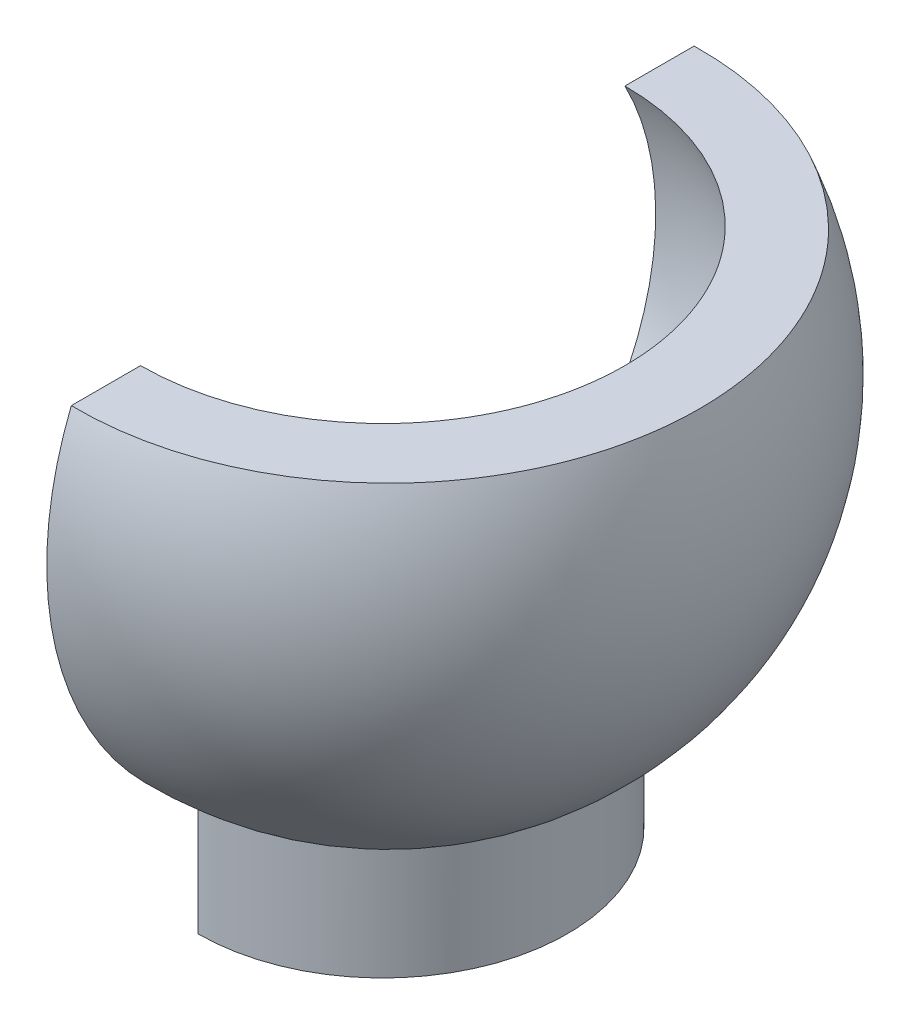
ISO-10303-21;
HEADER;
FILE_DESCRIPTION(('STEP AP214'),'2;1');
FILE_NAME('part.step','',(''),(''),'','','');
FILE_SCHEMA(('AUTOMOTIVE_DESIGN { 1 0 10303 214 1 1 1 1 }'));
ENDSEC;
DATA;
#1=APPLICATION_CONTEXT('core data for automotive mechanical design processes');
#2=APPLICATION_PROTOCOL_DEFINITION('international standard','automotive_design',2000,#1);
#3=PRODUCT_CONTEXT('',#1,'mechanical');
#4=PRODUCT('Part','Part','',(#3));
#5=PRODUCT_RELATED_PRODUCT_CATEGORY('part','',(#4));
#6=PRODUCT_DEFINITION_FORMATION('','',#4);
#7=PRODUCT_DEFINITION_CONTEXT('part definition',#1,'design');
#8=PRODUCT_DEFINITION('design','',#6,#7);
#9=PRODUCT_DEFINITION_SHAPE('','',#8);
#10=(LENGTH_UNIT() NAMED_UNIT(*) SI_UNIT(.MILLI.,.METRE.));
#11=(NAMED_UNIT(*) PLANE_ANGLE_UNIT() SI_UNIT($,.RADIAN.));
#12=(NAMED_UNIT(*) SI_UNIT($,.STERADIAN.) SOLID_ANGLE_UNIT());
#13=UNCERTAINTY_MEASURE_WITH_UNIT(LENGTH_MEASURE(1.E-05),#10,'distance_accuracy_value','');
#14=(GEOMETRIC_REPRESENTATION_CONTEXT(3) GLOBAL_UNCERTAINTY_ASSIGNED_CONTEXT((#13)) GLOBAL_UNIT_ASSIGNED_CONTEXT((#10,
#11,#12)) REPRESENTATION_CONTEXT('',''));
#15=CARTESIAN_POINT('',(0.,0.,0.));
#16=DIRECTION('',(0.,0.,1.));
#17=DIRECTION('',(1.,0.,0.));
#18=AXIS2_PLACEMENT_3D('',#15,#16,#17);
#19=CARTESIAN_POINT('',(0.318469420270132,0.,0.));
#20=DIRECTION('',(1.,0.,0.));
#21=DIRECTION('',(0.,0.,-1.));
#22=AXIS2_PLACEMENT_3D('',#19,#20,#21);
#23=SPHERICAL_SURFACE('',#22,20.);
#24=CARTESIAN_POINT('',(0.318469420270132,7.5,0.));
#25=DIRECTION('',(0.,-1.,0.));
#26=DIRECTION('',(0.,0.,1.));
#27=AXIS2_PLACEMENT_3D('',#24,#25,#26);
#28=CIRCLE('',#27,18.5404962177392);
#29=CARTESIAN_POINT('',(0.,7.5,-18.53776084721));
#30=VERTEX_POINT('',#29);
#31=CARTESIAN_POINT('',(0.,7.5,18.53776084721));
#32=VERTEX_POINT('',#31);
#33=EDGE_CURVE('E88',#30,#32,#28,.T.);
#34=ORIENTED_EDGE('',*,*,#33,.T.);
#35=CARTESIAN_POINT('',(0.,0.,0.));
#36=DIRECTION('',(-1.,0.,0.));
#37=DIRECTION('',(0.,0.,1.));
#38=AXIS2_PLACEMENT_3D('',#35,#36,#37);
#39=CIRCLE('',#38,19.9974642699607);
#40=CARTESIAN_POINT('',(0.,-16.7002568012696,11.));
#41=VERTEX_POINT('',#40);
#42=EDGE_CURVE('E121',#41,#32,#39,.T.);
#43=ORIENTED_EDGE('',*,*,#42,.F.);
#44=CARTESIAN_POINT('',(-10.4486910905099,-16.4998,3.43872861608761));
#45=CARTESIAN_POINT('',(-10.3520099832137,-16.5016660675455,3.73260385765806));
#46=CARTESIAN_POINT('',(-10.2428717104174,-16.5037722891326,4.02237271646154));
#47=CARTESIAN_POINT('',(-10.0005990145659,-16.5084467140785,4.59167935130273));
#48=CARTESIAN_POINT('',(-9.8674657602793,-16.5110148949357,4.87121762486325));
#49=CARTESIAN_POINT('',(-9.57821442973688,-16.5165931160298,5.41787961061132));
#50=CARTESIAN_POINT('',(-9.42211274310275,-16.5196028411887,5.68501199792606));
#51=CARTESIAN_POINT('',(-9.0879761495767,-16.5260431628054,6.20517762148084));
#52=CARTESIAN_POINT('',(-8.90994150481221,-16.5294737542332,6.45821102616962));
#53=CARTESIAN_POINT('',(-8.53311257688292,-16.536732433185,6.94849864948354));
#54=CARTESIAN_POINT('',(-8.33430864241363,-16.540560705503,7.18574544763739));
#55=CARTESIAN_POINT('',(-7.91742485755524,-16.5485853751575,7.64264483067634));
#56=CARTESIAN_POINT('',(-7.69934500212475,-16.5527817725904,7.86229741095986));
#57=CARTESIAN_POINT('',(-7.24550409597118,-16.5615112018977,8.28240715241219));
#58=CARTESIAN_POINT('',(-7.00974645052565,-16.566044168937,8.48286799363849));
#59=CARTESIAN_POINT('',(-6.52219028333347,-16.5754144098355,8.86321768096938));
#60=CARTESIAN_POINT('',(-6.27039183270186,-16.5802516823456,9.04310661826722));
#61=CARTESIAN_POINT('',(-5.75250380402007,-16.5901961666031,9.38106176216871));
#62=CARTESIAN_POINT('',(-5.48641208158701,-16.5953034188531,9.53912468149798));
#63=CARTESIAN_POINT('',(-4.94186328418899,-16.6057502040994,9.83227363910732));
#64=CARTESIAN_POINT('',(-4.66340618668138,-16.6110897375193,9.96735963549719));
#65=CARTESIAN_POINT('',(-4.09606315014395,-16.621963334255,10.2136140015553));
#66=CARTESIAN_POINT('',(-3.8071756361832,-16.6274974269449,10.3247787414696));
#67=CARTESIAN_POINT('',(-3.22106542257375,-16.6387195129622,10.5223752038536));
#68=CARTESIAN_POINT('',(-2.92384272576658,-16.6444075062371,10.6088069347547));
#69=CARTESIAN_POINT('',(-2.32313838200115,-16.6558972489325,10.7563326448529));
#70=CARTESIAN_POINT('',(-2.0196559838272,-16.6616990120022,10.8174235641532));
#71=CARTESIAN_POINT('',(-1.40862446542454,-16.6733740937544,10.9138187648366));
#72=CARTESIAN_POINT('',(-1.1010753445032,-16.6792474124493,10.9491230418277));
#73=CARTESIAN_POINT('',(-0.484115889868616,-16.6910233263341,10.9936928383378));
#74=CARTESIAN_POINT('',(-0.174705673000839,-16.696925919682,11.002959975798));
#75=CARTESIAN_POINT('',(0.443795718501033,-16.7087187637856,10.9953942932697));
#76=CARTESIAN_POINT('',(0.752886893148376,-16.7146090145417,10.978561474365));
#77=CARTESIAN_POINT('',(1.3685852901587,-16.7263360226243,10.9189122561017));
#78=CARTESIAN_POINT('',(1.67519225112046,-16.7321727743296,10.8760931574155));
#79=CARTESIAN_POINT('',(2.28370988979444,-16.743750902155,10.7647731339014));
#80=CARTESIAN_POINT('',(2.58562056691049,-16.749492278263,10.6962722058133));
#81=CARTESIAN_POINT('',(3.18260525764254,-16.7608393084394,10.5340733127363));
#82=CARTESIAN_POINT('',(3.47767912854026,-16.7664449596747,10.4403748222623));
#83=CARTESIAN_POINT('',(4.05888541093351,-16.7774810221449,10.2284469860156));
#84=CARTESIAN_POINT('',(4.34501782288489,-16.7829114333888,10.1102176414936));
#85=CARTESIAN_POINT('',(4.90629471890557,-16.7935587426303,9.85007334471878));
#86=CARTESIAN_POINT('',(5.18143965459545,-16.7987756494039,9.70815936722488));
#87=CARTESIAN_POINT('',(5.71879716220215,-16.8089597297368,9.40165060926966));
#88=CARTESIAN_POINT('',(5.98100973427018,-16.8139269032989,9.23705582907355));
#89=CARTESIAN_POINT('',(6.49063565710455,-16.8235768629414,8.88635613533882));
#90=CARTESIAN_POINT('',(6.73804910295006,-16.8282596508489,8.70025136001687));
#91=CARTESIAN_POINT('',(7.21631836733921,-16.8373083109268,8.30785342870468));
#92=CARTESIAN_POINT('',(7.44717418767978,-16.8416741831317,8.10156027490542));
#93=CARTESIAN_POINT('',(7.8906563429622,-16.8500581692213,7.67028028398163));
#94=CARTESIAN_POINT('',(8.10328506943565,-16.8540763287293,7.44529590693729));
#95=CARTESIAN_POINT('',(8.50883410247821,-16.8617377169598,6.97820909767695));
#96=CARTESIAN_POINT('',(8.70175441040194,-16.865380945708,6.73610666663752));
#97=CARTESIAN_POINT('',(9.06651386462534,-16.8722673022126,6.23650457808338));
#98=CARTESIAN_POINT('',(9.23835299298679,-16.8755104296284,5.97900490746725));
#99=CARTESIAN_POINT('',(9.55972680020424,-16.8815742076838,5.45043935237423));
#100=CARTESIAN_POINT('',(9.70926148162447,-16.8843948583721,5.17937346945698));
#101=CARTESIAN_POINT('',(9.9849377666958,-16.8895937983234,4.62565156724651));
#102=CARTESIAN_POINT('',(10.1110834598625,-16.8919721649192,4.34299758468201));
#103=CARTESIAN_POINT('',(10.3391162856015,-16.8962707894624,3.76806463740849));
#104=CARTESIAN_POINT('',(10.4410034209142,-16.8981910474616,3.47578567378682));
#105=CARTESIAN_POINT('',(10.6197938026897,-16.9015602599419,2.88368130908519));
#106=CARTESIAN_POINT('',(10.6966970746312,-16.9030092149037,2.58385591570148));
#107=CARTESIAN_POINT('',(10.8249724111361,-16.9054258765414,1.97879052527897));
#108=CARTESIAN_POINT('',(10.8763444775881,-16.9063935832529,1.67355052864074));
#109=CARTESIAN_POINT('',(10.9531862992757,-16.9078410075007,1.05986968490491));
#110=CARTESIAN_POINT('',(10.9786596779469,-16.9083207933009,0.75142929167029));
#111=CARTESIAN_POINT('',(11.0035354487566,-16.908789323739,0.133498621511905));
#112=CARTESIAN_POINT('',(11.0029378435888,-16.9087780684275,-0.175991655303387));
#113=CARTESIAN_POINT('',(10.9756759096898,-16.9082645940349,-0.793821462876034));
#114=CARTESIAN_POINT('',(10.9490115917817,-16.9077623751578,-1.10216099411113));
#115=CARTESIAN_POINT('',(10.869806034012,-16.9062704176933,-1.71549714916166));
#116=CARTESIAN_POINT('',(10.8172647942037,-16.9052806791069,-2.02049377298399));
#117=CARTESIAN_POINT('',(10.6866823927888,-16.9028205288884,-2.62496157383));
#118=CARTESIAN_POINT('',(10.6086424199275,-16.901350139664,-2.92443300774932));
#119=CARTESIAN_POINT('',(10.4276172303115,-16.8979387667137,-3.51573623907389));
#120=CARTESIAN_POINT('',(10.324632014827,-16.8959977830118,-3.80756803686811));
#121=CARTESIAN_POINT('',(10.0944490652742,-16.8916585513587,-4.38151786109732));
#122=CARTESIAN_POINT('',(9.96725131988663,-16.8892603031939,-4.66363588299111));
#123=CARTESIAN_POINT('',(9.68954829059844,-16.8840230317175,-5.21615303546429));
#124=CARTESIAN_POINT('',(9.53904300502315,-16.8811840083742,-5.48655216520169));
#125=CARTESIAN_POINT('',(9.21578463096101,-16.8750845243206,-6.01372784638748));
#126=CARTESIAN_POINT('',(9.04303004552077,-16.8718240352536,-6.27050347959168));
#127=CARTESIAN_POINT('',(8.67650983423113,-16.8649042484251,-6.76858799373889));
#128=CARTESIAN_POINT('',(8.48274420790317,-16.8612449506547,-7.00989687432962));
#129=CARTESIAN_POINT('',(8.07558020246493,-16.853552821479,-7.47533328335196));
#130=CARTESIAN_POINT('',(7.86218184242896,-16.8495199904368,-7.69946082847583));
#131=CARTESIAN_POINT('',(7.41726965204664,-16.8411086940044,-8.12894281901709));
#132=CARTESIAN_POINT('',(7.1857558196905,-16.836730228576,-8.33429726235173));
#133=CARTESIAN_POINT('',(6.70622263113865,-16.8276573376337,-8.72480396613765));
#134=CARTESIAN_POINT('',(6.45820080190027,-16.822962864778,-8.90995318865352));
#135=CARTESIAN_POINT('',(5.94744625089713,-16.8132911747974,-9.25869896832882));
#136=CARTESIAN_POINT('',(5.68471352782633,-16.8083139576473,-9.42229552357478));
#137=CARTESIAN_POINT('',(5.14640352441548,-16.798111427797,-9.72677503874337));
#138=CARTESIAN_POINT('',(4.87082617205261,-16.7928861137056,-9.86765787128513));
#139=CARTESIAN_POINT('',(4.30878713948868,-16.782223914907,-10.1257085148584));
#140=CARTESIAN_POINT('',(4.02232545801481,-16.7767870301751,-10.2428763231167));
#141=CARTESIAN_POINT('',(3.44050223296918,-16.7657387922299,-10.4526836562041));
#142=CARTESIAN_POINT('',(3.14513912416919,-16.7601274083272,-10.5453188388522));
#143=CARTESIAN_POINT('',(2.54766110912213,-16.748770515582,-10.7053758675295));
#144=CARTESIAN_POINT('',(2.24554620210348,-16.7430250067243,-10.7727977106772));
#145=CARTESIAN_POINT('',(1.63671609550183,-16.731440428984,-10.8819486386248));
#146=CARTESIAN_POINT('',(1.33000095610911,-16.7256013613257,-10.9236780592889));
#147=CARTESIAN_POINT('',(0.714146537759701,-16.7138708651346,-10.9811492859176));
#148=CARTESIAN_POINT('',(0.405007258785045,-16.7079794366014,-10.9968910916895));
#149=CARTESIAN_POINT('',(-0.213532674233275,-16.6961853353722,-11.0022756535453));
#150=CARTESIAN_POINT('',(-0.522933353489004,-16.6902826615002,-10.9919155113116));
#151=CARTESIAN_POINT('',(-1.13976234949737,-16.6785087156003,-10.9451636698207));
#152=CARTESIAN_POINT('',(-1.44719066575797,-16.6726374435804,-10.9087719640699));
#153=CARTESIAN_POINT('',(-2.05789829867899,-16.6609680366465,-10.8102140010129));
#154=CARTESIAN_POINT('',(-2.36117749380162,-16.6551699038755,-10.7480469903483));
#155=CARTESIAN_POINT('',(-2.96142125439994,-16.6436884724156,-10.5983799370239));
#156=CARTESIAN_POINT('',(-3.25838582392825,-16.6380051736531,-10.5108799106228));
#157=CARTESIAN_POINT('',(-3.84388957225686,-16.6267942215232,-10.3111681201724));
#158=CARTESIAN_POINT('',(-4.13242873475546,-16.6212665684569,-10.1989563083137));
#159=CARTESIAN_POINT('',(-4.69903000528824,-16.6104067378104,-9.9506177944535));
#160=CARTESIAN_POINT('',(-4.97709208412435,-16.6050745607748,-9.81449102581059));
#161=CARTESIAN_POINT('',(-5.52075881460794,-16.5946442782144,-9.5192909763738));
#162=CARTESIAN_POINT('',(-5.78636355213812,-16.5895461710758,-9.36021785380619));
#163=CARTESIAN_POINT('',(-6.30322539774932,-16.5796210083792,-9.02025654221474));
#164=CARTESIAN_POINT('',(-6.55448267310545,-16.574793949661,-8.83936860760338));
#165=CARTESIAN_POINT('',(-7.04088092854326,-16.5654456188017,-8.45704976555997));
#166=CARTESIAN_POINT('',(-7.27602086489207,-16.5609243664643,-8.2556175298097));
#167=CARTESIAN_POINT('',(-7.72849669721531,-16.5522208917737,-7.83364760966612));
#168=CARTESIAN_POINT('',(-7.94583239766744,-16.5480386731438,-7.61310971551327));
#169=CARTESIAN_POINT('',(-8.36109707607647,-16.5400449130939,-7.15455940115801));
#170=CARTESIAN_POINT('',(-8.55903063703988,-16.5362332841383,-6.91655113099988));
#171=CARTESIAN_POINT('',(-8.93411995155831,-16.5290079037086,-6.42472626270363));
#172=CARTESIAN_POINT('',(-9.11127951094772,-16.5255940793569,-6.17091257323262));
#173=CARTESIAN_POINT('',(-9.40026441544679,-16.5200238897408,-5.71728382909163));
#174=CARTESIAN_POINT('',(-9.51708571530023,-16.517771648658,-5.52063038839268));
#175=CARTESIAN_POINT('',(-9.73824866419202,-16.5135069854942,-5.12042679288211));
#176=CARTESIAN_POINT('',(-9.84259108842962,-16.5114945485165,-4.9168770674832));
#177=CARTESIAN_POINT('',(-10.0382688967867,-16.5077199348344,-4.50391941420344));
#178=CARTESIAN_POINT('',(-10.1296197512353,-16.5059574604823,-4.29451881531439));
#179=CARTESIAN_POINT('',(-10.2991369791872,-16.5026864327178,-3.87039995169055));
#180=CARTESIAN_POINT('',(-10.3773008767033,-16.5011779269909,-3.65568069698354));
#181=CARTESIAN_POINT('',(-10.4486910905099,-16.4998,-3.43872861608745));
#182=B_SPLINE_CURVE_WITH_KNOTS('',3,(#44,#45,#46,#47,#48,#49,#50,#51,#52,#53,#54,#55,#56,#57,
#58,#59,#60,#61,#62,#63,#64,#65,#66,#67,#68,#69,#70,#71,#72,#73,#74,#75,#76,#77,#78,#79,#80,#81,
#82,#83,#84,#85,#86,#87,#88,#89,#90,#91,#92,#93,#94,#95,#96,#97,#98,#99,#100,#101,#102,#103,
#104,#105,#106,#107,#108,#109,#110,#111,#112,#113,#114,#115,#116,#117,#118,#119,#120,#121,#122,
#123,#124,#125,#126,#127,#128,#129,#130,#131,#132,#133,#134,#135,#136,#137,#138,#139,#140,#141,
#142,#143,#144,#145,#146,#147,#148,#149,#150,#151,#152,#153,#154,#155,#156,#157,#158,#159,#160,
#161,#162,#163,#164,#165,#166,#167,#168,#169,#170,#171,#172,#173,#174,#175,#176,#177,#178,#179,
#180,#181),.UNSPECIFIED.,.F.,.F.,(4,2,2,2,2,2,2,2,2,2,2,2,2,2,2,2,2,2,2,2,2,2,2,2,2,2,2,2,2,2,2,
2,2,2,2,2,2,2,2,2,2,2,2,2,2,2,2,2,2,2,2,2,2,2,2,2,2,2,2,2,2,2,2,2,2,2,2,2,4),(0.,
0.927843860370731,1.85564253871705,2.78278234845758,3.70991107874351,4.63747257018442,
5.5650343042185,6.49241781854272,7.41979722170599,8.34731614794359,9.27483676516145,
10.2024980230381,11.1301589646726,12.0579318885529,12.9857049704517,13.91342039949,
14.8411357900027,15.7689475635491,16.6967594548774,17.6245906968549,18.5524218915296,
19.4802149100238,20.4080079176697,21.3357949639321,22.2635819095047,23.1912469355407,
24.1189118978158,25.0465776494469,25.974243294429,26.9017465857402,27.8292497722707,
28.7567520129226,29.684254184961,30.61162657409,31.5389988674037,32.4663707756706,
33.3937426820275,34.3210713606843,35.2483999921254,36.1757290570883,37.1030581886793,
38.0304497444541,38.9578413213519,39.8852319972454,40.8126227760272,41.740152800151,
42.6676829066212,43.5952182145935,44.5227536310316,45.4504531081423,46.37815269127,
47.3058401467805,48.2335276091697,49.1613180849998,50.0891087922684,51.0169266188301,
51.9447438499175,52.8725628760531,53.8003844876913,54.7281997018534,55.6560040965343,
56.583868517677,57.5117431270622,58.4393980310464,59.3668827205889,60.0527055224225,
60.7384856981572,61.423442285364,62.1085273374436),.UNSPECIFIED.);
#183=CARTESIAN_POINT('',(0.,-16.7002568012696,-11.));
#184=VERTEX_POINT('',#183);
#185=EDGE_CURVE('E45',#41,#184,#182,.T.);
#186=ORIENTED_EDGE('',*,*,#185,.T.);
#187=EDGE_CURVE('E80',#30,#184,#39,.T.);
#188=ORIENTED_EDGE('',*,*,#187,.F.);
#189=EDGE_LOOP('',(#34,#43,#186,#188));
#190=FACE_BOUND('',#189,.T.);
#191=ADVANCED_FACE('F37',(#190),#23,.T.);
#192=CARTESIAN_POINT('',(0.,7.5,0.));
#193=DIRECTION('',(0.,1.,0.));
#194=DIRECTION('',(0.,0.,1.));
#195=AXIS2_PLACEMENT_3D('',#192,#193,#194);
#196=PLANE('',#195);
#197=DIRECTION('',(0.,0.,1.));
#198=VECTOR('',#197,1.);
#199=CARTESIAN_POINT('',(0.,7.5,0.));
#200=LINE('',#199,#198);
#201=CARTESIAN_POINT('',(0.,7.5,-14.4157032433385));
#202=VERTEX_POINT('',#201);
#203=EDGE_CURVE('E115',#30,#202,#200,.T.);
#204=ORIENTED_EDGE('',*,*,#203,.T.);
#205=CARTESIAN_POINT('',(0.,7.5,0.));
#206=DIRECTION('',(0.,-1.,0.));
#207=DIRECTION('',(0.,0.,1.));
#208=AXIS2_PLACEMENT_3D('',#205,#206,#207);
#209=CIRCLE('',#208,14.4157032433385);
#210=CARTESIAN_POINT('',(0.,7.5,14.4157032433385));
#211=VERTEX_POINT('',#210);
#212=EDGE_CURVE('E85',#202,#211,#209,.T.);
#213=ORIENTED_EDGE('',*,*,#212,.T.);
#214=EDGE_CURVE('E119',#211,#32,#200,.T.);
#215=ORIENTED_EDGE('',*,*,#214,.T.);
#216=ORIENTED_EDGE('',*,*,#33,.F.);
#217=EDGE_LOOP('',(#204,#213,#215,#216));
#218=FACE_BOUND('',#217,.T.);
#219=ADVANCED_FACE('F105',(#218),#196,.T.);
#220=CARTESIAN_POINT('',(0.,0.,0.));
#221=DIRECTION('',(1.,0.,0.));
#222=DIRECTION('',(0.,1.,0.));
#223=AXIS2_PLACEMENT_3D('',#220,#221,#222);
#224=SPHERICAL_SURFACE('',#223,16.25);
#225=ORIENTED_EDGE('',*,*,#212,.F.);
#226=CARTESIAN_POINT('',(0.,0.,0.));
#227=DIRECTION('',(-1.,0.,0.));
#228=DIRECTION('',(0.,0.,1.));
#229=AXIS2_PLACEMENT_3D('',#226,#227,#228);
#230=CIRCLE('',#229,16.25);
#231=EDGE_CURVE('E117',#211,#202,#230,.F.);
#232=ORIENTED_EDGE('',*,*,#231,.F.);
#233=EDGE_LOOP('',(#225,#232));
#234=FACE_BOUND('',#233,.T.);
#235=ADVANCED_FACE('F102',(#234),#224,.F.);
#236=CARTESIAN_POINT('',(0.,-16.5,0.));
#237=DIRECTION('',(0.,-1.,0.));
#238=DIRECTION('',(0.,0.,-1.));
#239=AXIS2_PLACEMENT_3D('',#236,#237,#238);
#240=CYLINDRICAL_SURFACE('',#239,11.);
#241=ORIENTED_EDGE('',*,*,#185,.F.);
#242=DIRECTION('',(0.,-1.,0.));
#243=VECTOR('',#242,1.);
#244=CARTESIAN_POINT('',(0.,-16.5,11.));
#245=LINE('',#244,#243);
#246=CARTESIAN_POINT('',(0.,-23.5,11.));
#247=VERTEX_POINT('',#246);
#248=EDGE_CURVE('E84',#247,#41,#245,.F.);
#249=ORIENTED_EDGE('',*,*,#248,.F.);
#250=CARTESIAN_POINT('',(0.,-23.5,0.));
#251=DIRECTION('',(0.,-1.,0.));
#252=DIRECTION('',(0.,0.,1.));
#253=AXIS2_PLACEMENT_3D('',#250,#251,#252);
#254=CIRCLE('',#253,11.);
#255=CARTESIAN_POINT('',(0.,-23.5,-11.));
#256=VERTEX_POINT('',#255);
#257=EDGE_CURVE('E76',#256,#247,#254,.T.);
#258=ORIENTED_EDGE('',*,*,#257,.F.);
#259=DIRECTION('',(0.,-1.,0.));
#260=VECTOR('',#259,1.);
#261=CARTESIAN_POINT('',(0.,-16.5,-11.));
#262=LINE('',#261,#260);
#263=EDGE_CURVE('E57',#184,#256,#262,.T.);
#264=ORIENTED_EDGE('',*,*,#263,.F.);
#265=EDGE_LOOP('',(#241,#249,#258,#264));
#266=FACE_BOUND('',#265,.T.);
#267=ADVANCED_FACE('F83',(#266),#240,.T.);
#268=CARTESIAN_POINT('',(0.,-23.5,0.));
#269=DIRECTION('',(0.,1.,0.));
#270=DIRECTION('',(0.,0.,1.));
#271=AXIS2_PLACEMENT_3D('',#268,#269,#270);
#272=PLANE('',#271);
#273=ORIENTED_EDGE('',*,*,#257,.T.);
#274=DIRECTION('',(0.,0.,1.));
#275=VECTOR('',#274,1.);
#276=CARTESIAN_POINT('',(0.,-23.5,0.));
#277=LINE('',#276,#275);
#278=EDGE_CURVE('E11',#256,#247,#277,.T.);
#279=ORIENTED_EDGE('',*,*,#278,.F.);
#280=EDGE_LOOP('',(#273,#279));
#281=FACE_BOUND('',#280,.T.);
#282=ADVANCED_FACE('F75',(#281),#272,.F.);
#283=CARTESIAN_POINT('',(0.,16.5,-21.0145871077321));
#284=DIRECTION('',(1.,0.,0.));
#285=DIRECTION('',(0.,0.,1.));
#286=AXIS2_PLACEMENT_3D('',#283,#284,#285);
#287=PLANE('',#286);
#288=ORIENTED_EDGE('',*,*,#187,.T.);
#289=ORIENTED_EDGE('',*,*,#263,.T.);
#290=ORIENTED_EDGE('',*,*,#278,.T.);
#291=ORIENTED_EDGE('',*,*,#248,.T.);
#292=ORIENTED_EDGE('',*,*,#42,.T.);
#293=ORIENTED_EDGE('',*,*,#214,.F.);
#294=ORIENTED_EDGE('',*,*,#231,.T.);
#295=ORIENTED_EDGE('',*,*,#203,.F.);
#296=EDGE_LOOP('',(#288,#289,#290,#291,#292,#293,#294,#295));
#297=FACE_BOUND('',#296,.T.);
#298=ADVANCED_FACE('F78',(#297),#287,.F.);
#299=CLOSED_SHELL('',(#191,#219,#235,#267,#282,#298));
#300=MANIFOLD_SOLID_BREP('B2',#299);
#301=ADVANCED_BREP_SHAPE_REPRESENTATION('',(#18,#300),#14);
#302=SHAPE_DEFINITION_REPRESENTATION(#9,#301);
ENDSEC;
END-ISO-10303-21;
